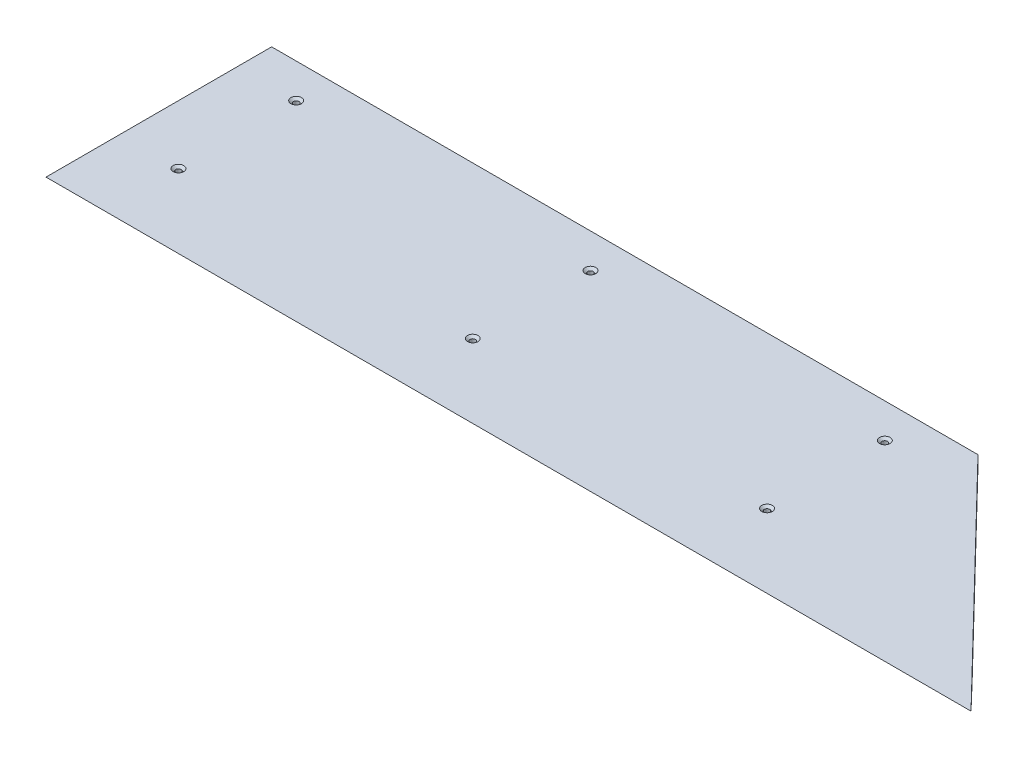
ISO-10303-21;
HEADER;
FILE_DESCRIPTION(('STEP AP214'),'2;1');
FILE_NAME('part.step','',(''),(''),'','','');
FILE_SCHEMA(('AUTOMOTIVE_DESIGN { 1 0 10303 214 1 1 1 1 }'));
ENDSEC;
DATA;
#1=APPLICATION_CONTEXT('core data for automotive mechanical design processes');
#2=APPLICATION_PROTOCOL_DEFINITION('international standard','automotive_design',2000,#1);
#3=PRODUCT_CONTEXT('',#1,'mechanical');
#4=PRODUCT('Part','Part','',(#3));
#5=PRODUCT_RELATED_PRODUCT_CATEGORY('part','',(#4));
#6=PRODUCT_DEFINITION_FORMATION('','',#4);
#7=PRODUCT_DEFINITION_CONTEXT('part definition',#1,'design');
#8=PRODUCT_DEFINITION('design','',#6,#7);
#9=PRODUCT_DEFINITION_SHAPE('','',#8);
#10=(LENGTH_UNIT() NAMED_UNIT(*) SI_UNIT(.MILLI.,.METRE.));
#11=(NAMED_UNIT(*) PLANE_ANGLE_UNIT() SI_UNIT($,.RADIAN.));
#12=(NAMED_UNIT(*) SI_UNIT($,.STERADIAN.) SOLID_ANGLE_UNIT());
#13=UNCERTAINTY_MEASURE_WITH_UNIT(LENGTH_MEASURE(1.E-05),#10,'distance_accuracy_value','');
#14=(GEOMETRIC_REPRESENTATION_CONTEXT(3) GLOBAL_UNCERTAINTY_ASSIGNED_CONTEXT((#13)) GLOBAL_UNIT_ASSIGNED_CONTEXT((#10,
#11,#12)) REPRESENTATION_CONTEXT('',''));
#15=CARTESIAN_POINT('',(0.,0.,0.));
#16=DIRECTION('',(0.,0.,1.));
#17=DIRECTION('',(1.,0.,0.));
#18=AXIS2_PLACEMENT_3D('',#15,#16,#17);
#19=CARTESIAN_POINT('',(381.,12.7,196.85));
#20=DIRECTION('',(0.,1.,0.));
#21=DIRECTION('',(0.,0.,1.));
#22=AXIS2_PLACEMENT_3D('',#19,#20,#21);
#23=CONICAL_SURFACE('',#22,6.85799999999998,0.872664625997165);
#24=CARTESIAN_POINT('',(381.,9.94208089623176,196.85));
#25=DIRECTION('',(0.,1.,0.));
#26=DIRECTION('',(0.,0.,1.));
#27=AXIS2_PLACEMENT_3D('',#24,#25,#26);
#28=CIRCLE('',#27,3.57123999999998);
#29=CARTESIAN_POINT('',(381.,9.94208089623176,200.42124));
#30=VERTEX_POINT('',#29);
#31=EDGE_CURVE('E11',#30,#30,#28,.T.);
#32=ORIENTED_EDGE('',*,*,#31,.F.);
#33=EDGE_LOOP('',(#32));
#34=FACE_BOUND('',#33,.T.);
#35=CARTESIAN_POINT('',(381.,12.7,196.85));
#36=DIRECTION('',(0.,1.,0.));
#37=DIRECTION('',(0.,0.,1.));
#38=AXIS2_PLACEMENT_3D('',#35,#36,#37);
#39=CIRCLE('',#38,6.85799999999998);
#40=CARTESIAN_POINT('',(381.,12.7,203.708));
#41=VERTEX_POINT('',#40);
#42=EDGE_CURVE('E120',#41,#41,#39,.T.);
#43=ORIENTED_EDGE('',*,*,#42,.T.);
#44=EDGE_LOOP('',(#43));
#45=FACE_BOUND('',#44,.T.);
#46=ADVANCED_FACE('F32',(#34,#45),#23,.F.);
#47=CARTESIAN_POINT('',(381.,12.7,196.85));
#48=DIRECTION('',(0.,1.,0.));
#49=DIRECTION('',(0.,0.,1.));
#50=AXIS2_PLACEMENT_3D('',#47,#48,#49);
#51=CYLINDRICAL_SURFACE('',#50,3.57123999999998);
#52=CARTESIAN_POINT('',(381.,0.,196.85));
#53=DIRECTION('',(0.,1.,0.));
#54=DIRECTION('',(0.,0.,1.));
#55=AXIS2_PLACEMENT_3D('',#52,#53,#54);
#56=CIRCLE('',#55,3.57123999999998);
#57=CARTESIAN_POINT('',(381.,0.,200.42124));
#58=VERTEX_POINT('',#57);
#59=EDGE_CURVE('E39',#58,#58,#56,.T.);
#60=ORIENTED_EDGE('',*,*,#59,.F.);
#61=EDGE_LOOP('',(#60));
#62=FACE_BOUND('',#61,.T.);
#63=ORIENTED_EDGE('',*,*,#31,.T.);
#64=EDGE_LOOP('',(#63));
#65=FACE_BOUND('',#64,.T.);
#66=ADVANCED_FACE('F127',(#62,#65),#51,.F.);
#67=CARTESIAN_POINT('',(381.,12.7,44.4499999999997));
#68=DIRECTION('',(0.,1.,0.));
#69=DIRECTION('',(0.,0.,1.));
#70=AXIS2_PLACEMENT_3D('',#67,#68,#69);
#71=CONICAL_SURFACE('',#70,6.85799999999998,0.872664625997165);
#72=CARTESIAN_POINT('',(381.,9.94208089623176,44.4499999999997));
#73=DIRECTION('',(0.,1.,0.));
#74=DIRECTION('',(0.,0.,1.));
#75=AXIS2_PLACEMENT_3D('',#72,#73,#74);
#76=CIRCLE('',#75,3.57123999999998);
#77=CARTESIAN_POINT('',(381.,9.94208089623176,48.0212399999997));
#78=VERTEX_POINT('',#77);
#79=EDGE_CURVE('E117',#78,#78,#76,.T.);
#80=ORIENTED_EDGE('',*,*,#79,.F.);
#81=EDGE_LOOP('',(#80));
#82=FACE_BOUND('',#81,.T.);
#83=CARTESIAN_POINT('',(381.,12.7,44.4499999999997));
#84=DIRECTION('',(0.,1.,0.));
#85=DIRECTION('',(0.,0.,1.));
#86=AXIS2_PLACEMENT_3D('',#83,#84,#85);
#87=CIRCLE('',#86,6.85799999999998);
#88=CARTESIAN_POINT('',(381.,12.7,51.3079999999997));
#89=VERTEX_POINT('',#88);
#90=EDGE_CURVE('E81',#89,#89,#87,.T.);
#91=ORIENTED_EDGE('',*,*,#90,.T.);
#92=EDGE_LOOP('',(#91));
#93=FACE_BOUND('',#92,.T.);
#94=ADVANCED_FACE('F130',(#82,#93),#71,.F.);
#95=CARTESIAN_POINT('',(381.,12.7,44.4499999999997));
#96=DIRECTION('',(0.,1.,0.));
#97=DIRECTION('',(0.,0.,1.));
#98=AXIS2_PLACEMENT_3D('',#95,#96,#97);
#99=CYLINDRICAL_SURFACE('',#98,3.57123999999998);
#100=CARTESIAN_POINT('',(381.,0.,44.4499999999997));
#101=DIRECTION('',(0.,1.,0.));
#102=DIRECTION('',(0.,0.,1.));
#103=AXIS2_PLACEMENT_3D('',#100,#101,#102);
#104=CIRCLE('',#103,3.57123999999998);
#105=CARTESIAN_POINT('',(381.,0.,48.0212399999997));
#106=VERTEX_POINT('',#105);
#107=EDGE_CURVE('E114',#106,#106,#104,.T.);
#108=ORIENTED_EDGE('',*,*,#107,.F.);
#109=EDGE_LOOP('',(#108));
#110=FACE_BOUND('',#109,.T.);
#111=ORIENTED_EDGE('',*,*,#79,.T.);
#112=EDGE_LOOP('',(#111));
#113=FACE_BOUND('',#112,.T.);
#114=ADVANCED_FACE('F160',(#110,#113),#99,.F.);
#115=CARTESIAN_POINT('',(-457.2,12.7,292.1));
#116=DIRECTION('',(1.,0.,0.));
#117=DIRECTION('',(0.,0.,-1.));
#118=AXIS2_PLACEMENT_3D('',#115,#116,#117);
#119=PLANE('',#118);
#120=DIRECTION('',(0.,0.,1.));
#121=VECTOR('',#120,1.);
#122=CARTESIAN_POINT('',(-457.2,0.,292.1));
#123=LINE('',#122,#121);
#124=CARTESIAN_POINT('',(-457.2,0.,0.));
#125=VERTEX_POINT('',#124);
#126=CARTESIAN_POINT('',(-457.2,0.,244.702954743876));
#127=VERTEX_POINT('',#126);
#128=EDGE_CURVE('E78',#125,#127,#123,.T.);
#129=ORIENTED_EDGE('',*,*,#128,.T.);
#130=DIRECTION('',(0.,0.258819045102523,0.965925826289068));
#131=VECTOR('',#130,1.);
#132=CARTESIAN_POINT('',(-457.2,12.6999999999999,292.1));
#133=LINE('',#132,#131);
#134=CARTESIAN_POINT('',(-457.2,12.7,292.1));
#135=VERTEX_POINT('',#134);
#136=EDGE_CURVE('E73',#127,#135,#133,.T.);
#137=ORIENTED_EDGE('',*,*,#136,.T.);
#138=DIRECTION('',(0.,0.,1.));
#139=VECTOR('',#138,1.);
#140=CARTESIAN_POINT('',(-457.2,12.7,292.1));
#141=LINE('',#140,#139);
#142=CARTESIAN_POINT('',(-457.2,12.7,0.));
#143=VERTEX_POINT('',#142);
#144=EDGE_CURVE('E77',#143,#135,#141,.T.);
#145=ORIENTED_EDGE('',*,*,#144,.F.);
#146=DIRECTION('',(0.,-1.,0.));
#147=VECTOR('',#146,1.);
#148=CARTESIAN_POINT('',(-457.2,12.7,0.));
#149=LINE('',#148,#147);
#150=EDGE_CURVE('E100',#143,#125,#149,.T.);
#151=ORIENTED_EDGE('',*,*,#150,.T.);
#152=EDGE_LOOP('',(#129,#137,#145,#151));
#153=FACE_BOUND('',#152,.T.);
#154=ADVANCED_FACE('F75',(#153),#119,.F.);
#155=CARTESIAN_POINT('',(457.2,12.7,-1.67972554971051E-13));
#156=DIRECTION('',(-0.718126297763185,0.,0.695912796592318));
#157=DIRECTION('',(0.695912796592318,0.,0.718126297763185));
#158=AXIS2_PLACEMENT_3D('',#155,#156,#157);
#159=PLANE('',#158);
#160=DIRECTION('',(-0.695912796592318,0.,-0.718126297763185));
#161=VECTOR('',#160,1.);
#162=CARTESIAN_POINT('',(457.2,12.7,-1.67972554971051E-13));
#163=LINE('',#162,#161);
#164=CARTESIAN_POINT('',(740.26459256231,12.7,292.1));
#165=VERTEX_POINT('',#164);
#166=CARTESIAN_POINT('',(457.2,12.7,-1.67972554971051E-13));
#167=VERTEX_POINT('',#166);
#168=EDGE_CURVE('E94',#165,#167,#163,.T.);
#169=ORIENTED_EDGE('',*,*,#168,.F.);
#170=DIRECTION('',(-0.683376443185712,-0.188955033292019,-0.705189784591678));
#171=VECTOR('',#170,1.);
#172=CARTESIAN_POINT('',(740.26459256231,12.7,292.1));
#173=LINE('',#172,#171);
#174=CARTESIAN_POINT('',(694.33366033334,0.,244.702954743876));
#175=VERTEX_POINT('',#174);
#176=EDGE_CURVE('E54',#165,#175,#173,.T.);
#177=ORIENTED_EDGE('',*,*,#176,.T.);
#178=DIRECTION('',(-0.695912796592318,0.,-0.718126297763185));
#179=VECTOR('',#178,1.);
#180=CARTESIAN_POINT('',(457.2,0.,-1.67972554971051E-13));
#181=LINE('',#180,#179);
#182=CARTESIAN_POINT('',(457.2,0.,-1.67972554971051E-13));
#183=VERTEX_POINT('',#182);
#184=EDGE_CURVE('E102',#175,#183,#181,.T.);
#185=ORIENTED_EDGE('',*,*,#184,.T.);
#186=DIRECTION('',(0.,-1.,0.));
#187=VECTOR('',#186,1.);
#188=CARTESIAN_POINT('',(457.2,12.7,-1.67972554971051E-13));
#189=LINE('',#188,#187);
#190=EDGE_CURVE('E107',#167,#183,#189,.T.);
#191=ORIENTED_EDGE('',*,*,#190,.F.);
#192=EDGE_LOOP('',(#169,#177,#185,#191));
#193=FACE_BOUND('',#192,.T.);
#194=ADVANCED_FACE('F147',(#193),#159,.F.);
#195=CARTESIAN_POINT('',(-457.2,12.7,0.));
#196=DIRECTION('',(0.,0.,1.));
#197=DIRECTION('',(1.,0.,0.));
#198=AXIS2_PLACEMENT_3D('',#195,#196,#197);
#199=PLANE('',#198);
#200=DIRECTION('',(-1.,0.,0.));
#201=VECTOR('',#200,1.);
#202=CARTESIAN_POINT('',(-457.2,0.,0.));
#203=LINE('',#202,#201);
#204=EDGE_CURVE('E91',#183,#125,#203,.T.);
#205=ORIENTED_EDGE('',*,*,#204,.T.);
#206=ORIENTED_EDGE('',*,*,#150,.F.);
#207=DIRECTION('',(-1.,0.,0.));
#208=VECTOR('',#207,1.);
#209=CARTESIAN_POINT('',(-457.2,12.7,0.));
#210=LINE('',#209,#208);
#211=EDGE_CURVE('E89',#167,#143,#210,.T.);
#212=ORIENTED_EDGE('',*,*,#211,.F.);
#213=ORIENTED_EDGE('',*,*,#190,.T.);
#214=EDGE_LOOP('',(#205,#206,#212,#213));
#215=FACE_BOUND('',#214,.T.);
#216=ADVANCED_FACE('F138',(#215),#199,.F.);
#217=CARTESIAN_POINT('',(0.,12.7,0.));
#218=DIRECTION('',(0.,-1.,0.));
#219=DIRECTION('',(0.,0.,-1.));
#220=AXIS2_PLACEMENT_3D('',#217,#218,#219);
#221=PLANE('',#220);
#222=CARTESIAN_POINT('',(0.,12.7,196.85));
#223=DIRECTION('',(0.,1.,0.));
#224=DIRECTION('',(0.,0.,1.));
#225=AXIS2_PLACEMENT_3D('',#222,#223,#224);
#226=CIRCLE('',#225,6.85799999999998);
#227=CARTESIAN_POINT('',(0.,12.7,203.708));
#228=VERTEX_POINT('',#227);
#229=EDGE_CURVE('E309',#228,#228,#226,.T.);
#230=ORIENTED_EDGE('',*,*,#229,.F.);
#231=EDGE_LOOP('',(#230));
#232=FACE_BOUND('',#231,.T.);
#233=CARTESIAN_POINT('',(0.,12.7,44.4499999999998));
#234=DIRECTION('',(0.,1.,0.));
#235=DIRECTION('',(0.,0.,1.));
#236=AXIS2_PLACEMENT_3D('',#233,#234,#235);
#237=CIRCLE('',#236,6.85799999999998);
#238=CARTESIAN_POINT('',(0.,12.7,51.3079999999998));
#239=VERTEX_POINT('',#238);
#240=EDGE_CURVE('E316',#239,#239,#237,.T.);
#241=ORIENTED_EDGE('',*,*,#240,.F.);
#242=EDGE_LOOP('',(#241));
#243=FACE_BOUND('',#242,.T.);
#244=CARTESIAN_POINT('',(-381.,12.7,44.4499999999998));
#245=DIRECTION('',(0.,1.,0.));
#246=DIRECTION('',(0.,0.,1.));
#247=AXIS2_PLACEMENT_3D('',#244,#245,#246);
#248=CIRCLE('',#247,6.85799999999998);
#249=CARTESIAN_POINT('',(-381.,12.7,51.3079999999998));
#250=VERTEX_POINT('',#249);
#251=EDGE_CURVE('E325',#250,#250,#248,.T.);
#252=ORIENTED_EDGE('',*,*,#251,.F.);
#253=EDGE_LOOP('',(#252));
#254=FACE_BOUND('',#253,.T.);
#255=CARTESIAN_POINT('',(-381.,12.7,196.85));
#256=DIRECTION('',(0.,1.,0.));
#257=DIRECTION('',(0.,0.,1.));
#258=AXIS2_PLACEMENT_3D('',#255,#256,#257);
#259=CIRCLE('',#258,6.85799999999998);
#260=CARTESIAN_POINT('',(-381.,12.7,203.708));
#261=VERTEX_POINT('',#260);
#262=EDGE_CURVE('E334',#261,#261,#259,.T.);
#263=ORIENTED_EDGE('',*,*,#262,.F.);
#264=EDGE_LOOP('',(#263));
#265=FACE_BOUND('',#264,.T.);
#266=ORIENTED_EDGE('',*,*,#144,.T.);
#267=DIRECTION('',(1.,0.,0.));
#268=VECTOR('',#267,1.);
#269=CARTESIAN_POINT('',(740.26459256231,12.7,292.1));
#270=LINE('',#269,#268);
#271=EDGE_CURVE('E87',#135,#165,#270,.T.);
#272=ORIENTED_EDGE('',*,*,#271,.T.);
#273=ORIENTED_EDGE('',*,*,#168,.T.);
#274=ORIENTED_EDGE('',*,*,#211,.T.);
#275=EDGE_LOOP('',(#266,#272,#273,#274));
#276=FACE_BOUND('',#275,.T.);
#277=ORIENTED_EDGE('',*,*,#90,.F.);
#278=EDGE_LOOP('',(#277));
#279=FACE_BOUND('',#278,.T.);
#280=ORIENTED_EDGE('',*,*,#42,.F.);
#281=EDGE_LOOP('',(#280));
#282=FACE_BOUND('',#281,.T.);
#283=ADVANCED_FACE('F85',(#232,#243,#254,#265,#276,#279,#282),#221,.F.);
#284=CARTESIAN_POINT('',(0.,0.,0.));
#285=DIRECTION('',(0.,-1.,0.));
#286=DIRECTION('',(0.,0.,-1.));
#287=AXIS2_PLACEMENT_3D('',#284,#285,#286);
#288=PLANE('',#287);
#289=CARTESIAN_POINT('',(0.,0.,196.85));
#290=DIRECTION('',(0.,1.,0.));
#291=DIRECTION('',(0.,0.,1.));
#292=AXIS2_PLACEMENT_3D('',#289,#290,#291);
#293=CIRCLE('',#292,3.57123999999998);
#294=CARTESIAN_POINT('',(0.,0.,200.42124));
#295=VERTEX_POINT('',#294);
#296=EDGE_CURVE('E310',#295,#295,#293,.T.);
#297=ORIENTED_EDGE('',*,*,#296,.T.);
#298=EDGE_LOOP('',(#297));
#299=FACE_BOUND('',#298,.T.);
#300=CARTESIAN_POINT('',(0.,0.,44.4499999999998));
#301=DIRECTION('',(0.,1.,0.));
#302=DIRECTION('',(0.,0.,1.));
#303=AXIS2_PLACEMENT_3D('',#300,#301,#302);
#304=CIRCLE('',#303,3.57123999999998);
#305=CARTESIAN_POINT('',(0.,0.,48.0212399999998));
#306=VERTEX_POINT('',#305);
#307=EDGE_CURVE('E319',#306,#306,#304,.T.);
#308=ORIENTED_EDGE('',*,*,#307,.T.);
#309=EDGE_LOOP('',(#308));
#310=FACE_BOUND('',#309,.T.);
#311=CARTESIAN_POINT('',(-381.,0.,44.4499999999998));
#312=DIRECTION('',(0.,1.,0.));
#313=DIRECTION('',(0.,0.,1.));
#314=AXIS2_PLACEMENT_3D('',#311,#312,#313);
#315=CIRCLE('',#314,3.57123999999998);
#316=CARTESIAN_POINT('',(-381.,0.,48.0212399999998));
#317=VERTEX_POINT('',#316);
#318=EDGE_CURVE('E331',#317,#317,#315,.T.);
#319=ORIENTED_EDGE('',*,*,#318,.T.);
#320=EDGE_LOOP('',(#319));
#321=FACE_BOUND('',#320,.T.);
#322=CARTESIAN_POINT('',(-381.,0.,196.85));
#323=DIRECTION('',(0.,1.,0.));
#324=DIRECTION('',(0.,0.,1.));
#325=AXIS2_PLACEMENT_3D('',#322,#323,#324);
#326=CIRCLE('',#325,3.57123999999998);
#327=CARTESIAN_POINT('',(-381.,0.,200.42124));
#328=VERTEX_POINT('',#327);
#329=EDGE_CURVE('E103',#328,#328,#326,.T.);
#330=ORIENTED_EDGE('',*,*,#329,.T.);
#331=EDGE_LOOP('',(#330));
#332=FACE_BOUND('',#331,.T.);
#333=ORIENTED_EDGE('',*,*,#184,.F.);
#334=DIRECTION('',(-1.,0.,0.));
#335=VECTOR('',#334,1.);
#336=CARTESIAN_POINT('',(-457.2,0.,244.702954743876));
#337=LINE('',#336,#335);
#338=EDGE_CURVE('E46',#175,#127,#337,.T.);
#339=ORIENTED_EDGE('',*,*,#338,.T.);
#340=ORIENTED_EDGE('',*,*,#128,.F.);
#341=ORIENTED_EDGE('',*,*,#204,.F.);
#342=EDGE_LOOP('',(#333,#339,#340,#341));
#343=FACE_BOUND('',#342,.T.);
#344=ORIENTED_EDGE('',*,*,#107,.T.);
#345=EDGE_LOOP('',(#344));
#346=FACE_BOUND('',#345,.T.);
#347=ORIENTED_EDGE('',*,*,#59,.T.);
#348=EDGE_LOOP('',(#347));
#349=FACE_BOUND('',#348,.T.);
#350=ADVANCED_FACE('F125',(#299,#310,#321,#332,#343,#346,#349),#288,.T.);
#351=CARTESIAN_POINT('',(740.26459256231,12.7,292.1));
#352=DIRECTION('',(0.,-0.965925826289068,0.258819045102523));
#353=DIRECTION('',(-1.,0.,0.));
#354=AXIS2_PLACEMENT_3D('',#351,#352,#353);
#355=PLANE('',#354);
#356=ORIENTED_EDGE('',*,*,#136,.F.);
#357=ORIENTED_EDGE('',*,*,#338,.F.);
#358=ORIENTED_EDGE('',*,*,#176,.F.);
#359=ORIENTED_EDGE('',*,*,#271,.F.);
#360=EDGE_LOOP('',(#356,#357,#358,#359));
#361=FACE_BOUND('',#360,.T.);
#362=ADVANCED_FACE('F93',(#361),#355,.T.);
#363=CARTESIAN_POINT('',(-381.,12.7,196.85));
#364=DIRECTION('',(0.,1.,0.));
#365=DIRECTION('',(0.,0.,1.));
#366=AXIS2_PLACEMENT_3D('',#363,#364,#365);
#367=CYLINDRICAL_SURFACE('',#366,3.57123999999998);
#368=ORIENTED_EDGE('',*,*,#329,.F.);
#369=EDGE_LOOP('',(#368));
#370=FACE_BOUND('',#369,.T.);
#371=CARTESIAN_POINT('',(-381.,9.94208089623176,196.85));
#372=DIRECTION('',(0.,1.,0.));
#373=DIRECTION('',(0.,0.,1.));
#374=AXIS2_PLACEMENT_3D('',#371,#372,#373);
#375=CIRCLE('',#374,3.57123999999998);
#376=CARTESIAN_POINT('',(-381.,9.94208089623176,200.42124));
#377=VERTEX_POINT('',#376);
#378=EDGE_CURVE('E337',#377,#377,#375,.T.);
#379=ORIENTED_EDGE('',*,*,#378,.T.);
#380=EDGE_LOOP('',(#379));
#381=FACE_BOUND('',#380,.T.);
#382=ADVANCED_FACE('F153',(#370,#381),#367,.F.);
#383=CARTESIAN_POINT('',(-381.,12.7,196.85));
#384=DIRECTION('',(0.,1.,0.));
#385=DIRECTION('',(0.,0.,1.));
#386=AXIS2_PLACEMENT_3D('',#383,#384,#385);
#387=CONICAL_SURFACE('',#386,6.85799999999998,0.872664625997165);
#388=ORIENTED_EDGE('',*,*,#378,.F.);
#389=EDGE_LOOP('',(#388));
#390=FACE_BOUND('',#389,.T.);
#391=ORIENTED_EDGE('',*,*,#262,.T.);
#392=EDGE_LOOP('',(#391));
#393=FACE_BOUND('',#392,.T.);
#394=ADVANCED_FACE('F219',(#390,#393),#387,.F.);
#395=CARTESIAN_POINT('',(-381.,12.7,44.4499999999998));
#396=DIRECTION('',(0.,1.,0.));
#397=DIRECTION('',(0.,0.,1.));
#398=AXIS2_PLACEMENT_3D('',#395,#396,#397);
#399=CYLINDRICAL_SURFACE('',#398,3.57123999999998);
#400=ORIENTED_EDGE('',*,*,#318,.F.);
#401=EDGE_LOOP('',(#400));
#402=FACE_BOUND('',#401,.T.);
#403=CARTESIAN_POINT('',(-381.,9.94208089623176,44.4499999999998));
#404=DIRECTION('',(0.,1.,0.));
#405=DIRECTION('',(0.,0.,1.));
#406=AXIS2_PLACEMENT_3D('',#403,#404,#405);
#407=CIRCLE('',#406,3.57123999999998);
#408=CARTESIAN_POINT('',(-381.,9.94208089623176,48.0212399999998));
#409=VERTEX_POINT('',#408);
#410=EDGE_CURVE('E328',#409,#409,#407,.T.);
#411=ORIENTED_EDGE('',*,*,#410,.T.);
#412=EDGE_LOOP('',(#411));
#413=FACE_BOUND('',#412,.T.);
#414=ADVANCED_FACE('F227',(#402,#413),#399,.F.);
#415=CARTESIAN_POINT('',(-381.,12.7,44.4499999999998));
#416=DIRECTION('',(0.,1.,0.));
#417=DIRECTION('',(0.,0.,1.));
#418=AXIS2_PLACEMENT_3D('',#415,#416,#417);
#419=CONICAL_SURFACE('',#418,6.85799999999998,0.872664625997165);
#420=ORIENTED_EDGE('',*,*,#410,.F.);
#421=EDGE_LOOP('',(#420));
#422=FACE_BOUND('',#421,.T.);
#423=ORIENTED_EDGE('',*,*,#251,.T.);
#424=EDGE_LOOP('',(#423));
#425=FACE_BOUND('',#424,.T.);
#426=ADVANCED_FACE('F235',(#422,#425),#419,.F.);
#427=CARTESIAN_POINT('',(0.,12.7,44.4499999999998));
#428=DIRECTION('',(0.,1.,0.));
#429=DIRECTION('',(0.,0.,1.));
#430=AXIS2_PLACEMENT_3D('',#427,#428,#429);
#431=CYLINDRICAL_SURFACE('',#430,3.57123999999998);
#432=ORIENTED_EDGE('',*,*,#307,.F.);
#433=EDGE_LOOP('',(#432));
#434=FACE_BOUND('',#433,.T.);
#435=CARTESIAN_POINT('',(0.,9.94208089623176,44.4499999999998));
#436=DIRECTION('',(0.,1.,0.));
#437=DIRECTION('',(0.,0.,1.));
#438=AXIS2_PLACEMENT_3D('',#435,#436,#437);
#439=CIRCLE('',#438,3.57123999999998);
#440=CARTESIAN_POINT('',(0.,9.94208089623176,48.0212399999998));
#441=VERTEX_POINT('',#440);
#442=EDGE_CURVE('E322',#441,#441,#439,.T.);
#443=ORIENTED_EDGE('',*,*,#442,.T.);
#444=EDGE_LOOP('',(#443));
#445=FACE_BOUND('',#444,.T.);
#446=ADVANCED_FACE('F244',(#434,#445),#431,.F.);
#447=CARTESIAN_POINT('',(0.,12.7,44.4499999999998));
#448=DIRECTION('',(0.,1.,0.));
#449=DIRECTION('',(0.,0.,1.));
#450=AXIS2_PLACEMENT_3D('',#447,#448,#449);
#451=CONICAL_SURFACE('',#450,6.85799999999998,0.872664625997165);
#452=ORIENTED_EDGE('',*,*,#442,.F.);
#453=EDGE_LOOP('',(#452));
#454=FACE_BOUND('',#453,.T.);
#455=ORIENTED_EDGE('',*,*,#240,.T.);
#456=EDGE_LOOP('',(#455));
#457=FACE_BOUND('',#456,.T.);
#458=ADVANCED_FACE('F265',(#454,#457),#451,.F.);
#459=CARTESIAN_POINT('',(0.,12.7,196.85));
#460=DIRECTION('',(0.,1.,0.));
#461=DIRECTION('',(0.,0.,1.));
#462=AXIS2_PLACEMENT_3D('',#459,#460,#461);
#463=CYLINDRICAL_SURFACE('',#462,3.57123999999998);
#464=ORIENTED_EDGE('',*,*,#296,.F.);
#465=EDGE_LOOP('',(#464));
#466=FACE_BOUND('',#465,.T.);
#467=CARTESIAN_POINT('',(0.,9.94208089623176,196.85));
#468=DIRECTION('',(0.,1.,0.));
#469=DIRECTION('',(0.,0.,1.));
#470=AXIS2_PLACEMENT_3D('',#467,#468,#469);
#471=CIRCLE('',#470,3.57123999999998);
#472=CARTESIAN_POINT('',(0.,9.94208089623176,200.42124));
#473=VERTEX_POINT('',#472);
#474=EDGE_CURVE('E307',#473,#473,#471,.T.);
#475=ORIENTED_EDGE('',*,*,#474,.T.);
#476=EDGE_LOOP('',(#475));
#477=FACE_BOUND('',#476,.T.);
#478=ADVANCED_FACE('F274',(#466,#477),#463,.F.);
#479=CARTESIAN_POINT('',(0.,12.7,196.85));
#480=DIRECTION('',(0.,1.,0.));
#481=DIRECTION('',(0.,0.,1.));
#482=AXIS2_PLACEMENT_3D('',#479,#480,#481);
#483=CONICAL_SURFACE('',#482,6.85799999999998,0.872664625997165);
#484=ORIENTED_EDGE('',*,*,#474,.F.);
#485=EDGE_LOOP('',(#484));
#486=FACE_BOUND('',#485,.T.);
#487=ORIENTED_EDGE('',*,*,#229,.T.);
#488=EDGE_LOOP('',(#487));
#489=FACE_BOUND('',#488,.T.);
#490=ADVANCED_FACE('F283',(#486,#489),#483,.F.);
#491=CLOSED_SHELL('',(#46,#66,#94,#114,#154,#194,#216,#283,#350,#362,#382,#394,#414,#426,#446,
#458,#478,#490));
#492=MANIFOLD_SOLID_BREP('B2',#491);
#493=ADVANCED_BREP_SHAPE_REPRESENTATION('',(#18,#492),#14);
#494=SHAPE_DEFINITION_REPRESENTATION(#9,#493);
ENDSEC;
END-ISO-10303-21;
